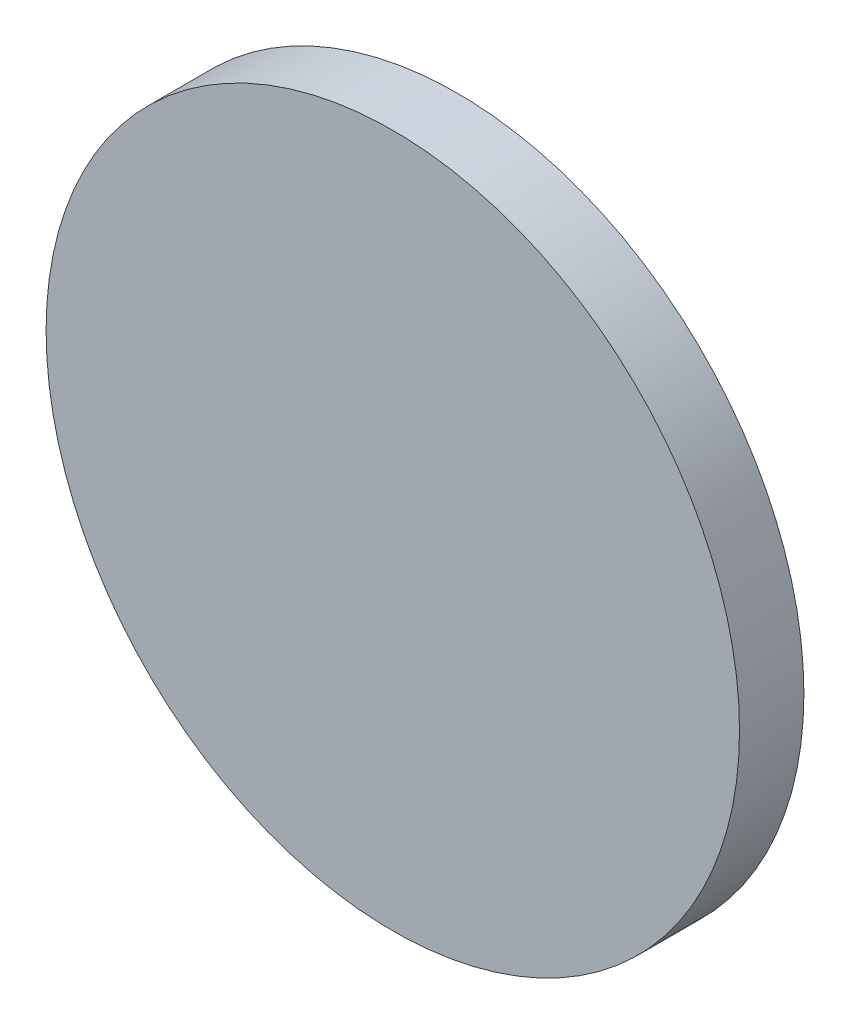
ISO-10303-21;
HEADER;
FILE_DESCRIPTION(('STEP AP214'),'2;1');
FILE_NAME('part.step','',(''),(''),'','','');
FILE_SCHEMA(('AUTOMOTIVE_DESIGN { 1 0 10303 214 1 1 1 1 }'));
ENDSEC;
DATA;
#1=APPLICATION_CONTEXT('core data for automotive mechanical design processes');
#2=APPLICATION_PROTOCOL_DEFINITION('international standard','automotive_design',2000,#1);
#3=PRODUCT_CONTEXT('',#1,'mechanical');
#4=PRODUCT('Part','Part','',(#3));
#5=PRODUCT_RELATED_PRODUCT_CATEGORY('part','',(#4));
#6=PRODUCT_DEFINITION_FORMATION('','',#4);
#7=PRODUCT_DEFINITION_CONTEXT('part definition',#1,'design');
#8=PRODUCT_DEFINITION('design','',#6,#7);
#9=PRODUCT_DEFINITION_SHAPE('','',#8);
#10=(LENGTH_UNIT() NAMED_UNIT(*) SI_UNIT(.MILLI.,.METRE.));
#11=(NAMED_UNIT(*) PLANE_ANGLE_UNIT() SI_UNIT($,.RADIAN.));
#12=(NAMED_UNIT(*) SI_UNIT($,.STERADIAN.) SOLID_ANGLE_UNIT());
#13=UNCERTAINTY_MEASURE_WITH_UNIT(LENGTH_MEASURE(1.E-05),#10,'distance_accuracy_value','');
#14=(GEOMETRIC_REPRESENTATION_CONTEXT(3) GLOBAL_UNCERTAINTY_ASSIGNED_CONTEXT((#13)) GLOBAL_UNIT_ASSIGNED_CONTEXT((#10,
#11,#12)) REPRESENTATION_CONTEXT('',''));
#15=CARTESIAN_POINT('',(0.,0.,0.));
#16=DIRECTION('',(0.,0.,1.));
#17=DIRECTION('',(1.,0.,0.));
#18=AXIS2_PLACEMENT_3D('',#15,#16,#17);
#19=CARTESIAN_POINT('',(0.,0.,6.5));
#20=DIRECTION('',(0.,0.,-1.));
#21=DIRECTION('',(-1.,0.,0.));
#22=AXIS2_PLACEMENT_3D('',#19,#20,#21);
#23=CYLINDRICAL_SURFACE('',#22,35.);
#24=CARTESIAN_POINT('',(0.,0.,6.5));
#25=DIRECTION('',(0.,0.,1.));
#26=DIRECTION('',(1.,0.,0.));
#27=AXIS2_PLACEMENT_3D('',#24,#25,#26);
#28=CIRCLE('',#27,35.);
#29=CARTESIAN_POINT('',(35.,0.,6.5));
#30=VERTEX_POINT('',#29);
#31=EDGE_CURVE('E10',#30,#30,#28,.T.);
#32=ORIENTED_EDGE('',*,*,#31,.F.);
#33=EDGE_LOOP('',(#32));
#34=FACE_BOUND('',#33,.T.);
#35=CARTESIAN_POINT('',(0.,0.,0.));
#36=DIRECTION('',(0.,0.,1.));
#37=DIRECTION('',(1.,0.,0.));
#38=AXIS2_PLACEMENT_3D('',#35,#36,#37);
#39=CIRCLE('',#38,35.);
#40=CARTESIAN_POINT('',(35.,0.,0.));
#41=VERTEX_POINT('',#40);
#42=EDGE_CURVE('E40',#41,#41,#39,.T.);
#43=ORIENTED_EDGE('',*,*,#42,.T.);
#44=EDGE_LOOP('',(#43));
#45=FACE_BOUND('',#44,.T.);
#46=ADVANCED_FACE('F37',(#34,#45),#23,.T.);
#47=CARTESIAN_POINT('',(0.,0.,6.5));
#48=DIRECTION('',(0.,0.,1.));
#49=DIRECTION('',(1.,0.,0.));
#50=AXIS2_PLACEMENT_3D('',#47,#48,#49);
#51=PLANE('',#50);
#52=ORIENTED_EDGE('',*,*,#31,.T.);
#53=EDGE_LOOP('',(#52));
#54=FACE_BOUND('',#53,.T.);
#55=ADVANCED_FACE('F52',(#54),#51,.T.);
#56=CARTESIAN_POINT('',(0.,0.,0.));
#57=DIRECTION('',(0.,0.,1.));
#58=DIRECTION('',(1.,0.,0.));
#59=AXIS2_PLACEMENT_3D('',#56,#57,#58);
#60=PLANE('',#59);
#61=ORIENTED_EDGE('',*,*,#42,.F.);
#62=EDGE_LOOP('',(#61));
#63=FACE_BOUND('',#62,.T.);
#64=ADVANCED_FACE('F50',(#63),#60,.F.);
#65=CLOSED_SHELL('',(#46,#55,#64));
#66=MANIFOLD_SOLID_BREP('B2',#65);
#67=ADVANCED_BREP_SHAPE_REPRESENTATION('',(#18,#66),#14);
#68=SHAPE_DEFINITION_REPRESENTATION(#9,#67);
ENDSEC;
END-ISO-10303-21;
